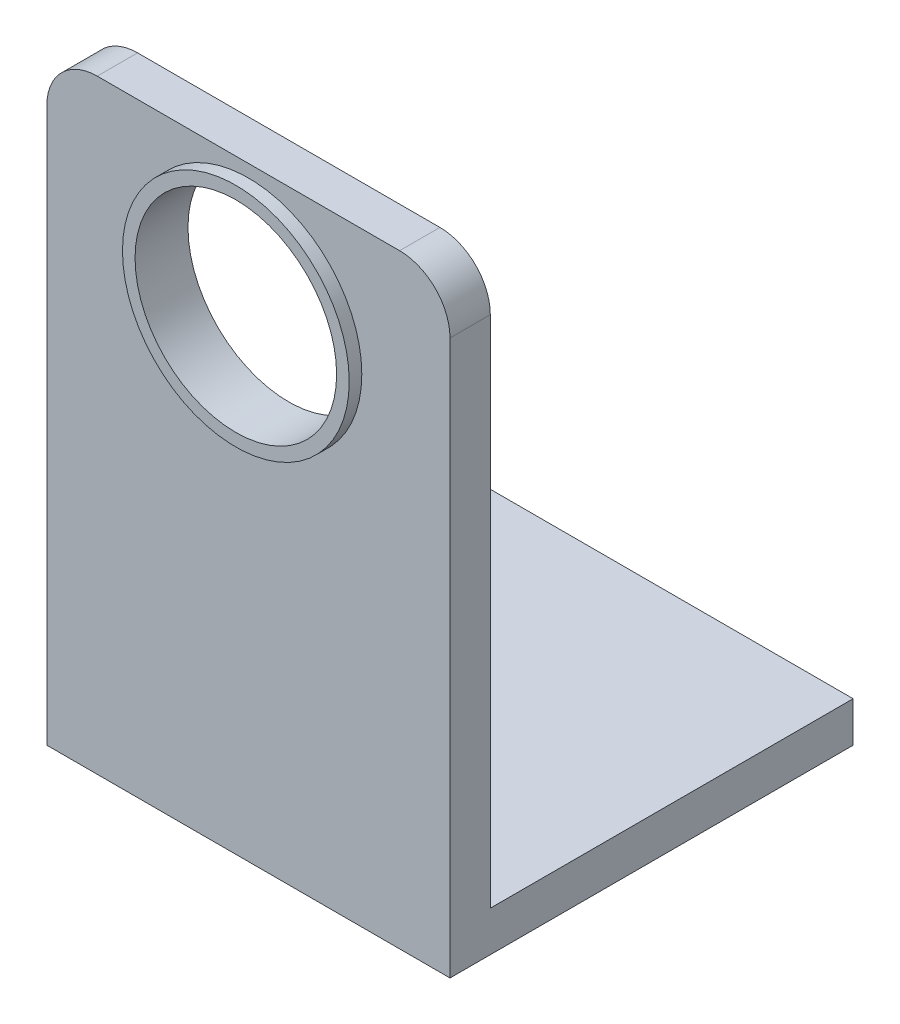
ISO-10303-21;
HEADER;
FILE_DESCRIPTION(('STEP AP214'),'2;1');
FILE_NAME('part.step','',(''),(''),'','','');
FILE_SCHEMA(('AUTOMOTIVE_DESIGN { 1 0 10303 214 1 1 1 1 }'));
ENDSEC;
DATA;
#1=APPLICATION_CONTEXT('core data for automotive mechanical design processes');
#2=APPLICATION_PROTOCOL_DEFINITION('international standard','automotive_design',2000,#1);
#3=PRODUCT_CONTEXT('',#1,'mechanical');
#4=PRODUCT('Part','Part','',(#3));
#5=PRODUCT_RELATED_PRODUCT_CATEGORY('part','',(#4));
#6=PRODUCT_DEFINITION_FORMATION('','',#4);
#7=PRODUCT_DEFINITION_CONTEXT('part definition',#1,'design');
#8=PRODUCT_DEFINITION('design','',#6,#7);
#9=PRODUCT_DEFINITION_SHAPE('','',#8);
#10=(LENGTH_UNIT() NAMED_UNIT(*) SI_UNIT(.MILLI.,.METRE.));
#11=(NAMED_UNIT(*) PLANE_ANGLE_UNIT() SI_UNIT($,.RADIAN.));
#12=(NAMED_UNIT(*) SI_UNIT($,.STERADIAN.) SOLID_ANGLE_UNIT());
#13=UNCERTAINTY_MEASURE_WITH_UNIT(LENGTH_MEASURE(1.E-05),#10,'distance_accuracy_value','');
#14=(GEOMETRIC_REPRESENTATION_CONTEXT(3) GLOBAL_UNCERTAINTY_ASSIGNED_CONTEXT((#13)) GLOBAL_UNIT_ASSIGNED_CONTEXT((#10,
#11,#12)) REPRESENTATION_CONTEXT('',''));
#15=CARTESIAN_POINT('',(0.,0.,0.));
#16=DIRECTION('',(0.,0.,1.));
#17=DIRECTION('',(1.,0.,0.));
#18=AXIS2_PLACEMENT_3D('',#15,#16,#17);
#19=CARTESIAN_POINT('',(25.4,0.,0.));
#20=DIRECTION('',(0.,0.,-1.));
#21=DIRECTION('',(-1.,0.,0.));
#22=AXIS2_PLACEMENT_3D('',#19,#20,#21);
#23=PLANE('',#22);
#24=DIRECTION('',(-1.,0.,0.));
#25=VECTOR('',#24,1.);
#26=CARTESIAN_POINT('',(25.4,38.1,0.));
#27=LINE('',#26,#25);
#28=CARTESIAN_POINT('',(22.225,38.1,0.));
#29=VERTEX_POINT('',#28);
#30=CARTESIAN_POINT('',(3.175,38.1,0.));
#31=VERTEX_POINT('',#30);
#32=EDGE_CURVE('E183',#29,#31,#27,.T.);
#33=ORIENTED_EDGE('',*,*,#32,.T.);
#34=CARTESIAN_POINT('',(3.175,34.925,0.));
#35=DIRECTION('',(0.,0.,-1.));
#36=DIRECTION('',(-1.,0.,0.));
#37=AXIS2_PLACEMENT_3D('',#34,#35,#36);
#38=CIRCLE('',#37,3.175);
#39=CARTESIAN_POINT('',(0.,34.925,0.));
#40=VERTEX_POINT('',#39);
#41=EDGE_CURVE('E160',#31,#40,#38,.F.);
#42=ORIENTED_EDGE('',*,*,#41,.T.);
#43=DIRECTION('',(0.,-1.,0.));
#44=VECTOR('',#43,1.);
#45=CARTESIAN_POINT('',(0.,0.,0.));
#46=LINE('',#45,#44);
#47=CARTESIAN_POINT('',(0.,0.,0.));
#48=VERTEX_POINT('',#47);
#49=EDGE_CURVE('E141',#40,#48,#46,.T.);
#50=ORIENTED_EDGE('',*,*,#49,.T.);
#51=DIRECTION('',(-1.,0.,0.));
#52=VECTOR('',#51,1.);
#53=CARTESIAN_POINT('',(25.4,0.,0.));
#54=LINE('',#53,#52);
#55=CARTESIAN_POINT('',(25.4,0.,0.));
#56=VERTEX_POINT('',#55);
#57=EDGE_CURVE('E132',#56,#48,#54,.T.);
#58=ORIENTED_EDGE('',*,*,#57,.F.);
#59=DIRECTION('',(0.,-1.,0.));
#60=VECTOR('',#59,1.);
#61=CARTESIAN_POINT('',(25.4,0.,0.));
#62=LINE('',#61,#60);
#63=CARTESIAN_POINT('',(25.4,34.925,0.));
#64=VERTEX_POINT('',#63);
#65=EDGE_CURVE('E118',#64,#56,#62,.T.);
#66=ORIENTED_EDGE('',*,*,#65,.F.);
#67=CARTESIAN_POINT('',(22.225,34.925,0.));
#68=DIRECTION('',(0.,0.,-1.));
#69=DIRECTION('',(-1.,0.,0.));
#70=AXIS2_PLACEMENT_3D('',#67,#68,#69);
#71=CIRCLE('',#70,3.175);
#72=EDGE_CURVE('E157',#64,#29,#71,.F.);
#73=ORIENTED_EDGE('',*,*,#72,.T.);
#74=EDGE_LOOP('',(#33,#42,#50,#58,#66,#73));
#75=FACE_BOUND('',#74,.T.);
#76=CARTESIAN_POINT('',(12.7,30.1625,0.));
#77=DIRECTION('',(0.,0.,-1.));
#78=DIRECTION('',(-1.,0.,0.));
#79=AXIS2_PLACEMENT_3D('',#76,#77,#78);
#80=CIRCLE('',#79,7.14375);
#81=CARTESIAN_POINT('',(5.55625,30.1625,0.));
#82=VERTEX_POINT('',#81);
#83=EDGE_CURVE('E11',#82,#82,#80,.F.);
#84=ORIENTED_EDGE('',*,*,#83,.F.);
#85=EDGE_LOOP('',(#84));
#86=FACE_BOUND('',#85,.T.);
#87=ADVANCED_FACE('F38',(#75,#86),#23,.F.);
#88=CARTESIAN_POINT('',(25.4,0.,0.));
#89=DIRECTION('',(0.,1.,0.));
#90=DIRECTION('',(0.,0.,1.));
#91=AXIS2_PLACEMENT_3D('',#88,#89,#90);
#92=PLANE('',#91);
#93=DIRECTION('',(0.,0.,-1.));
#94=VECTOR('',#93,1.);
#95=CARTESIAN_POINT('',(0.,0.,0.));
#96=LINE('',#95,#94);
#97=CARTESIAN_POINT('',(0.,0.,-25.4));
#98=VERTEX_POINT('',#97);
#99=EDGE_CURVE('E188',#48,#98,#96,.T.);
#100=ORIENTED_EDGE('',*,*,#99,.T.);
#101=DIRECTION('',(-1.,0.,0.));
#102=VECTOR('',#101,1.);
#103=CARTESIAN_POINT('',(25.4,0.,-25.4));
#104=LINE('',#103,#102);
#105=CARTESIAN_POINT('',(25.4,0.,-25.4));
#106=VERTEX_POINT('',#105);
#107=EDGE_CURVE('E134',#106,#98,#104,.T.);
#108=ORIENTED_EDGE('',*,*,#107,.F.);
#109=DIRECTION('',(0.,0.,-1.));
#110=VECTOR('',#109,1.);
#111=CARTESIAN_POINT('',(25.4,0.,0.));
#112=LINE('',#111,#110);
#113=EDGE_CURVE('E121',#56,#106,#112,.T.);
#114=ORIENTED_EDGE('',*,*,#113,.F.);
#115=ORIENTED_EDGE('',*,*,#57,.T.);
#116=EDGE_LOOP('',(#100,#108,#114,#115));
#117=FACE_BOUND('',#116,.T.);
#118=ADVANCED_FACE('F131',(#117),#92,.F.);
#119=CARTESIAN_POINT('',(25.4,0.,-25.4));
#120=DIRECTION('',(0.,0.,1.));
#121=DIRECTION('',(1.,0.,0.));
#122=AXIS2_PLACEMENT_3D('',#119,#120,#121);
#123=PLANE('',#122);
#124=DIRECTION('',(0.,1.,0.));
#125=VECTOR('',#124,1.);
#126=CARTESIAN_POINT('',(0.,0.,-25.4));
#127=LINE('',#126,#125);
#128=CARTESIAN_POINT('',(0.,2.54,-25.4));
#129=VERTEX_POINT('',#128);
#130=EDGE_CURVE('E191',#98,#129,#127,.T.);
#131=ORIENTED_EDGE('',*,*,#130,.T.);
#132=DIRECTION('',(-1.,0.,0.));
#133=VECTOR('',#132,1.);
#134=CARTESIAN_POINT('',(25.4,2.54,-25.4));
#135=LINE('',#134,#133);
#136=CARTESIAN_POINT('',(25.4,2.54,-25.4));
#137=VERTEX_POINT('',#136);
#138=EDGE_CURVE('E150',#137,#129,#135,.T.);
#139=ORIENTED_EDGE('',*,*,#138,.F.);
#140=DIRECTION('',(0.,1.,0.));
#141=VECTOR('',#140,1.);
#142=CARTESIAN_POINT('',(25.4,0.,-25.4));
#143=LINE('',#142,#141);
#144=EDGE_CURVE('E137',#106,#137,#143,.T.);
#145=ORIENTED_EDGE('',*,*,#144,.F.);
#146=ORIENTED_EDGE('',*,*,#107,.T.);
#147=EDGE_LOOP('',(#131,#139,#145,#146));
#148=FACE_BOUND('',#147,.T.);
#149=ADVANCED_FACE('F220',(#148),#123,.F.);
#150=CARTESIAN_POINT('',(25.4,2.54,-2.54));
#151=DIRECTION('',(0.,-1.,0.));
#152=DIRECTION('',(0.,0.,-1.));
#153=AXIS2_PLACEMENT_3D('',#150,#151,#152);
#154=PLANE('',#153);
#155=DIRECTION('',(0.,0.,1.));
#156=VECTOR('',#155,1.);
#157=CARTESIAN_POINT('',(0.,2.54,-2.54));
#158=LINE('',#157,#156);
#159=CARTESIAN_POINT('',(0.,2.54,-2.54));
#160=VERTEX_POINT('',#159);
#161=EDGE_CURVE('E202',#129,#160,#158,.T.);
#162=ORIENTED_EDGE('',*,*,#161,.T.);
#163=DIRECTION('',(-1.,0.,0.));
#164=VECTOR('',#163,1.);
#165=CARTESIAN_POINT('',(25.4,2.54,-2.54));
#166=LINE('',#165,#164);
#167=CARTESIAN_POINT('',(25.4,2.54,-2.54));
#168=VERTEX_POINT('',#167);
#169=EDGE_CURVE('E182',#168,#160,#166,.T.);
#170=ORIENTED_EDGE('',*,*,#169,.F.);
#171=DIRECTION('',(0.,0.,1.));
#172=VECTOR('',#171,1.);
#173=CARTESIAN_POINT('',(25.4,2.54,-2.54));
#174=LINE('',#173,#172);
#175=EDGE_CURVE('E218',#137,#168,#174,.T.);
#176=ORIENTED_EDGE('',*,*,#175,.F.);
#177=ORIENTED_EDGE('',*,*,#138,.T.);
#178=EDGE_LOOP('',(#162,#170,#176,#177));
#179=FACE_BOUND('',#178,.T.);
#180=ADVANCED_FACE('F216',(#179),#154,.F.);
#181=CARTESIAN_POINT('',(25.4,2.54,-2.54));
#182=DIRECTION('',(0.,0.,1.));
#183=DIRECTION('',(1.,0.,0.));
#184=AXIS2_PLACEMENT_3D('',#181,#182,#183);
#185=PLANE('',#184);
#186=CARTESIAN_POINT('',(12.7,30.1625,-2.54));
#187=DIRECTION('',(0.,0.,-1.));
#188=DIRECTION('',(-1.,0.,0.));
#189=AXIS2_PLACEMENT_3D('',#186,#187,#188);
#190=CIRCLE('',#189,6.35);
#191=CARTESIAN_POINT('',(6.35,30.1625,-2.54));
#192=VERTEX_POINT('',#191);
#193=EDGE_CURVE('E189',#192,#192,#190,.T.);
#194=ORIENTED_EDGE('',*,*,#193,.F.);
#195=EDGE_LOOP('',(#194));
#196=FACE_BOUND('',#195,.T.);
#197=DIRECTION('',(0.,1.,0.));
#198=VECTOR('',#197,1.);
#199=CARTESIAN_POINT('',(0.,2.54,-2.54));
#200=LINE('',#199,#198);
#201=CARTESIAN_POINT('',(0.,34.925,-2.54));
#202=VERTEX_POINT('',#201);
#203=EDGE_CURVE('E127',#160,#202,#200,.T.);
#204=ORIENTED_EDGE('',*,*,#203,.T.);
#205=CARTESIAN_POINT('',(3.175,34.925,-2.54));
#206=DIRECTION('',(0.,0.,1.));
#207=DIRECTION('',(1.,0.,0.));
#208=AXIS2_PLACEMENT_3D('',#205,#206,#207);
#209=CIRCLE('',#208,3.175);
#210=CARTESIAN_POINT('',(3.175,38.1,-2.54));
#211=VERTEX_POINT('',#210);
#212=EDGE_CURVE('E167',#202,#211,#209,.F.);
#213=ORIENTED_EDGE('',*,*,#212,.T.);
#214=DIRECTION('',(-1.,0.,0.));
#215=VECTOR('',#214,1.);
#216=CARTESIAN_POINT('',(25.4,38.1,-2.54));
#217=LINE('',#216,#215);
#218=CARTESIAN_POINT('',(22.225,38.1,-2.54));
#219=VERTEX_POINT('',#218);
#220=EDGE_CURVE('E173',#219,#211,#217,.T.);
#221=ORIENTED_EDGE('',*,*,#220,.F.);
#222=CARTESIAN_POINT('',(22.225,34.925,-2.54));
#223=DIRECTION('',(0.,0.,1.));
#224=DIRECTION('',(1.,0.,0.));
#225=AXIS2_PLACEMENT_3D('',#222,#223,#224);
#226=CIRCLE('',#225,3.175);
#227=CARTESIAN_POINT('',(25.4,34.925,-2.54));
#228=VERTEX_POINT('',#227);
#229=EDGE_CURVE('E54',#219,#228,#226,.F.);
#230=ORIENTED_EDGE('',*,*,#229,.T.);
#231=DIRECTION('',(0.,1.,0.));
#232=VECTOR('',#231,1.);
#233=CARTESIAN_POINT('',(25.4,2.54,-2.54));
#234=LINE('',#233,#232);
#235=EDGE_CURVE('E198',#168,#228,#234,.T.);
#236=ORIENTED_EDGE('',*,*,#235,.F.);
#237=ORIENTED_EDGE('',*,*,#169,.T.);
#238=EDGE_LOOP('',(#204,#213,#221,#230,#236,#237));
#239=FACE_BOUND('',#238,.T.);
#240=ADVANCED_FACE('F172',(#196,#239),#185,.F.);
#241=CARTESIAN_POINT('',(25.4,38.1,0.));
#242=DIRECTION('',(0.,-1.,0.));
#243=DIRECTION('',(0.,0.,-1.));
#244=AXIS2_PLACEMENT_3D('',#241,#242,#243);
#245=PLANE('',#244);
#246=ORIENTED_EDGE('',*,*,#220,.T.);
#247=DIRECTION('',(0.,0.,1.));
#248=VECTOR('',#247,1.);
#249=CARTESIAN_POINT('',(3.175,38.1,0.));
#250=LINE('',#249,#248);
#251=EDGE_CURVE('E147',#211,#31,#250,.T.);
#252=ORIENTED_EDGE('',*,*,#251,.T.);
#253=ORIENTED_EDGE('',*,*,#32,.F.);
#254=DIRECTION('',(0.,0.,1.));
#255=VECTOR('',#254,1.);
#256=CARTESIAN_POINT('',(22.225,38.1,0.));
#257=LINE('',#256,#255);
#258=EDGE_CURVE('E144',#29,#219,#257,.F.);
#259=ORIENTED_EDGE('',*,*,#258,.T.);
#260=EDGE_LOOP('',(#246,#252,#253,#259));
#261=FACE_BOUND('',#260,.T.);
#262=ADVANCED_FACE('F178',(#261),#245,.F.);
#263=CARTESIAN_POINT('',(25.4,0.,0.));
#264=DIRECTION('',(-1.,0.,0.));
#265=DIRECTION('',(0.,0.,1.));
#266=AXIS2_PLACEMENT_3D('',#263,#264,#265);
#267=PLANE('',#266);
#268=ORIENTED_EDGE('',*,*,#235,.T.);
#269=DIRECTION('',(0.,0.,1.));
#270=VECTOR('',#269,1.);
#271=CARTESIAN_POINT('',(25.4,34.925,0.));
#272=LINE('',#271,#270);
#273=EDGE_CURVE('E47',#228,#64,#272,.T.);
#274=ORIENTED_EDGE('',*,*,#273,.T.);
#275=ORIENTED_EDGE('',*,*,#65,.T.);
#276=ORIENTED_EDGE('',*,*,#113,.T.);
#277=ORIENTED_EDGE('',*,*,#144,.T.);
#278=ORIENTED_EDGE('',*,*,#175,.T.);
#279=EDGE_LOOP('',(#268,#274,#275,#276,#277,#278));
#280=FACE_BOUND('',#279,.T.);
#281=ADVANCED_FACE('F120',(#280),#267,.F.);
#282=CARTESIAN_POINT('',(0.,0.,0.));
#283=DIRECTION('',(-1.,0.,0.));
#284=DIRECTION('',(0.,0.,1.));
#285=AXIS2_PLACEMENT_3D('',#282,#283,#284);
#286=PLANE('',#285);
#287=ORIENTED_EDGE('',*,*,#49,.F.);
#288=DIRECTION('',(0.,0.,1.));
#289=VECTOR('',#288,1.);
#290=CARTESIAN_POINT('',(0.,34.925,-2.54));
#291=LINE('',#290,#289);
#292=EDGE_CURVE('E64',#40,#202,#291,.F.);
#293=ORIENTED_EDGE('',*,*,#292,.T.);
#294=ORIENTED_EDGE('',*,*,#203,.F.);
#295=ORIENTED_EDGE('',*,*,#161,.F.);
#296=ORIENTED_EDGE('',*,*,#130,.F.);
#297=ORIENTED_EDGE('',*,*,#99,.F.);
#298=EDGE_LOOP('',(#287,#293,#294,#295,#296,#297));
#299=FACE_BOUND('',#298,.T.);
#300=ADVANCED_FACE('F186',(#299),#286,.T.);
#301=CARTESIAN_POINT('',(12.7,30.1625,0.00100000000000013));
#302=DIRECTION('',(0.,0.,-1.));
#303=DIRECTION('',(-1.,0.,0.));
#304=AXIS2_PLACEMENT_3D('',#301,#302,#303);
#305=CYLINDRICAL_SURFACE('',#304,6.35);
#306=ORIENTED_EDGE('',*,*,#193,.T.);
#307=EDGE_LOOP('',(#306));
#308=FACE_BOUND('',#307,.T.);
#309=CARTESIAN_POINT('',(12.7,30.1625,0.79375));
#310=DIRECTION('',(0.,0.,1.));
#311=DIRECTION('',(1.,0.,0.));
#312=AXIS2_PLACEMENT_3D('',#309,#310,#311);
#313=CIRCLE('',#312,6.35);
#314=CARTESIAN_POINT('',(19.05,30.1625,0.79375));
#315=VERTEX_POINT('',#314);
#316=EDGE_CURVE('E227',#315,#315,#313,.T.);
#317=ORIENTED_EDGE('',*,*,#316,.T.);
#318=EDGE_LOOP('',(#317));
#319=FACE_BOUND('',#318,.T.);
#320=ADVANCED_FACE('F232',(#308,#319),#305,.F.);
#321=CARTESIAN_POINT('',(3.175,34.925,0.));
#322=DIRECTION('',(0.,0.,-1.));
#323=DIRECTION('',(-1.,0.,0.));
#324=AXIS2_PLACEMENT_3D('',#321,#322,#323);
#325=CYLINDRICAL_SURFACE('',#324,3.175);
#326=ORIENTED_EDGE('',*,*,#212,.F.);
#327=ORIENTED_EDGE('',*,*,#292,.F.);
#328=ORIENTED_EDGE('',*,*,#41,.F.);
#329=ORIENTED_EDGE('',*,*,#251,.F.);
#330=EDGE_LOOP('',(#326,#327,#328,#329));
#331=FACE_BOUND('',#330,.T.);
#332=ADVANCED_FACE('F185',(#331),#325,.T.);
#333=CARTESIAN_POINT('',(22.225,34.925,0.));
#334=DIRECTION('',(0.,0.,1.));
#335=DIRECTION('',(1.,0.,0.));
#336=AXIS2_PLACEMENT_3D('',#333,#334,#335);
#337=CYLINDRICAL_SURFACE('',#336,3.175);
#338=ORIENTED_EDGE('',*,*,#229,.F.);
#339=ORIENTED_EDGE('',*,*,#258,.F.);
#340=ORIENTED_EDGE('',*,*,#72,.F.);
#341=ORIENTED_EDGE('',*,*,#273,.F.);
#342=EDGE_LOOP('',(#338,#339,#340,#341));
#343=FACE_BOUND('',#342,.T.);
#344=ADVANCED_FACE('F40',(#343),#337,.T.);
#345=CARTESIAN_POINT('',(12.7,30.1625,0.79375));
#346=DIRECTION('',(0.,0.,1.));
#347=DIRECTION('',(1.,0.,0.));
#348=AXIS2_PLACEMENT_3D('',#345,#346,#347);
#349=PLANE('',#348);
#350=CARTESIAN_POINT('',(12.7,30.1625,0.79375));
#351=DIRECTION('',(0.,0.,1.));
#352=DIRECTION('',(1.,0.,0.));
#353=AXIS2_PLACEMENT_3D('',#350,#351,#352);
#354=CIRCLE('',#353,7.14375);
#355=CARTESIAN_POINT('',(19.84375,30.1625,0.79375));
#356=VERTEX_POINT('',#355);
#357=EDGE_CURVE('E195',#356,#356,#354,.T.);
#358=ORIENTED_EDGE('',*,*,#357,.T.);
#359=EDGE_LOOP('',(#358));
#360=FACE_BOUND('',#359,.T.);
#361=ORIENTED_EDGE('',*,*,#316,.F.);
#362=EDGE_LOOP('',(#361));
#363=FACE_BOUND('',#362,.T.);
#364=ADVANCED_FACE('F234',(#360,#363),#349,.T.);
#365=CARTESIAN_POINT('',(12.7,30.1625,0.79375));
#366=DIRECTION('',(0.,0.,-1.));
#367=DIRECTION('',(-1.,0.,0.));
#368=AXIS2_PLACEMENT_3D('',#365,#366,#367);
#369=CYLINDRICAL_SURFACE('',#368,7.14375);
#370=ORIENTED_EDGE('',*,*,#357,.F.);
#371=EDGE_LOOP('',(#370));
#372=FACE_BOUND('',#371,.T.);
#373=ORIENTED_EDGE('',*,*,#83,.T.);
#374=EDGE_LOOP('',(#373));
#375=FACE_BOUND('',#374,.T.);
#376=ADVANCED_FACE('F236',(#372,#375),#369,.T.);
#377=CLOSED_SHELL('',(#87,#118,#149,#180,#240,#262,#281,#300,#320,#332,#344,#364,#376));
#378=MANIFOLD_SOLID_BREP('B2',#377);
#379=ADVANCED_BREP_SHAPE_REPRESENTATION('',(#18,#378),#14);
#380=SHAPE_DEFINITION_REPRESENTATION(#9,#379);
ENDSEC;
END-ISO-10303-21;
